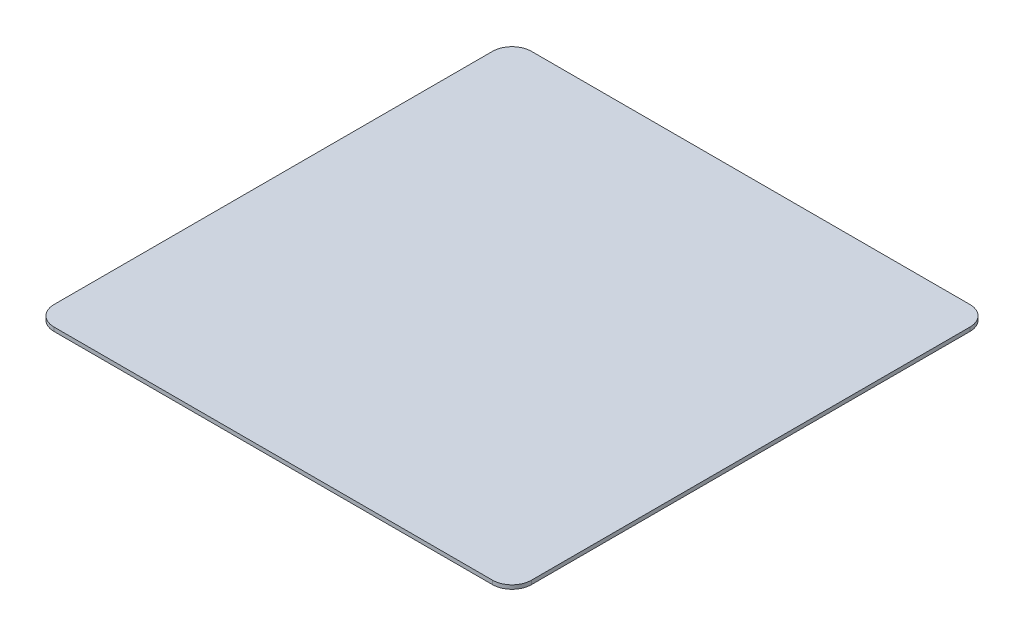
ISO-10303-21;
HEADER;
FILE_DESCRIPTION(('STEP AP214'),'2;1');
FILE_NAME('part.step','',(''),(''),'','','');
FILE_SCHEMA(('AUTOMOTIVE_DESIGN { 1 0 10303 214 1 1 1 1 }'));
ENDSEC;
DATA;
#1=APPLICATION_CONTEXT('core data for automotive mechanical design processes');
#2=APPLICATION_PROTOCOL_DEFINITION('international standard','automotive_design',2000,#1);
#3=PRODUCT_CONTEXT('',#1,'mechanical');
#4=PRODUCT('Part','Part','',(#3));
#5=PRODUCT_RELATED_PRODUCT_CATEGORY('part','',(#4));
#6=PRODUCT_DEFINITION_FORMATION('','',#4);
#7=PRODUCT_DEFINITION_CONTEXT('part definition',#1,'design');
#8=PRODUCT_DEFINITION('design','',#6,#7);
#9=PRODUCT_DEFINITION_SHAPE('','',#8);
#10=(LENGTH_UNIT() NAMED_UNIT(*) SI_UNIT(.MILLI.,.METRE.));
#11=(NAMED_UNIT(*) PLANE_ANGLE_UNIT() SI_UNIT($,.RADIAN.));
#12=(NAMED_UNIT(*) SI_UNIT($,.STERADIAN.) SOLID_ANGLE_UNIT());
#13=UNCERTAINTY_MEASURE_WITH_UNIT(LENGTH_MEASURE(1.E-05),#10,'distance_accuracy_value','');
#14=(GEOMETRIC_REPRESENTATION_CONTEXT(3) GLOBAL_UNCERTAINTY_ASSIGNED_CONTEXT((#13)) GLOBAL_UNIT_ASSIGNED_CONTEXT((#10,
#11,#12)) REPRESENTATION_CONTEXT('',''));
#15=CARTESIAN_POINT('',(0.,0.,0.));
#16=DIRECTION('',(0.,0.,1.));
#17=DIRECTION('',(1.,0.,0.));
#18=AXIS2_PLACEMENT_3D('',#15,#16,#17);
#19=CARTESIAN_POINT('',(122.5,2.,-122.5));
#20=DIRECTION('',(-1.,0.,0.));
#21=DIRECTION('',(0.,0.,1.));
#22=AXIS2_PLACEMENT_3D('',#19,#20,#21);
#23=PLANE('',#22);
#24=DIRECTION('',(0.,0.,-1.));
#25=VECTOR('',#24,1.);
#26=CARTESIAN_POINT('',(122.5,0.,-122.5));
#27=LINE('',#26,#25);
#28=CARTESIAN_POINT('',(122.5,0.,112.5));
#29=VERTEX_POINT('',#28);
#30=CARTESIAN_POINT('',(122.5,0.,-112.5));
#31=VERTEX_POINT('',#30);
#32=EDGE_CURVE('E135',#29,#31,#27,.T.);
#33=ORIENTED_EDGE('',*,*,#32,.T.);
#34=DIRECTION('',(0.,-1.,0.));
#35=VECTOR('',#34,1.);
#36=CARTESIAN_POINT('',(122.5,2.,-112.5));
#37=LINE('',#36,#35);
#38=CARTESIAN_POINT('',(122.5,2.,-112.5));
#39=VERTEX_POINT('',#38);
#40=EDGE_CURVE('E157',#31,#39,#37,.F.);
#41=ORIENTED_EDGE('',*,*,#40,.T.);
#42=DIRECTION('',(0.,0.,-1.));
#43=VECTOR('',#42,1.);
#44=CARTESIAN_POINT('',(122.5,2.,-122.5));
#45=LINE('',#44,#43);
#46=CARTESIAN_POINT('',(122.5,2.,112.5));
#47=VERTEX_POINT('',#46);
#48=EDGE_CURVE('E133',#47,#39,#45,.T.);
#49=ORIENTED_EDGE('',*,*,#48,.F.);
#50=DIRECTION('',(0.,-1.,0.));
#51=VECTOR('',#50,1.);
#52=CARTESIAN_POINT('',(122.5,2.,112.5));
#53=LINE('',#52,#51);
#54=EDGE_CURVE('E154',#47,#29,#53,.T.);
#55=ORIENTED_EDGE('',*,*,#54,.T.);
#56=EDGE_LOOP('',(#33,#41,#49,#55));
#57=FACE_BOUND('',#56,.T.);
#58=ADVANCED_FACE('F38',(#57),#23,.F.);
#59=CARTESIAN_POINT('',(-122.5,2.,-122.5));
#60=DIRECTION('',(0.,0.,1.));
#61=DIRECTION('',(1.,0.,0.));
#62=AXIS2_PLACEMENT_3D('',#59,#60,#61);
#63=PLANE('',#62);
#64=DIRECTION('',(-1.,0.,0.));
#65=VECTOR('',#64,1.);
#66=CARTESIAN_POINT('',(-122.5,0.,-122.5));
#67=LINE('',#66,#65);
#68=CARTESIAN_POINT('',(112.5,0.,-122.5));
#69=VERTEX_POINT('',#68);
#70=CARTESIAN_POINT('',(-112.5,0.,-122.5));
#71=VERTEX_POINT('',#70);
#72=EDGE_CURVE('E131',#69,#71,#67,.T.);
#73=ORIENTED_EDGE('',*,*,#72,.T.);
#74=DIRECTION('',(0.,-1.,0.));
#75=VECTOR('',#74,1.);
#76=CARTESIAN_POINT('',(-112.5,2.,-122.5));
#77=LINE('',#76,#75);
#78=CARTESIAN_POINT('',(-112.5,2.,-122.5));
#79=VERTEX_POINT('',#78);
#80=EDGE_CURVE('E109',#71,#79,#77,.F.);
#81=ORIENTED_EDGE('',*,*,#80,.T.);
#82=DIRECTION('',(-1.,0.,0.));
#83=VECTOR('',#82,1.);
#84=CARTESIAN_POINT('',(-122.5,2.,-122.5));
#85=LINE('',#84,#83);
#86=CARTESIAN_POINT('',(112.5,2.,-122.5));
#87=VERTEX_POINT('',#86);
#88=EDGE_CURVE('E171',#87,#79,#85,.T.);
#89=ORIENTED_EDGE('',*,*,#88,.F.);
#90=DIRECTION('',(0.,-1.,0.));
#91=VECTOR('',#90,1.);
#92=CARTESIAN_POINT('',(112.5,2.,-122.5));
#93=LINE('',#92,#91);
#94=EDGE_CURVE('E114',#87,#69,#93,.T.);
#95=ORIENTED_EDGE('',*,*,#94,.T.);
#96=EDGE_LOOP('',(#73,#81,#89,#95));
#97=FACE_BOUND('',#96,.T.);
#98=ADVANCED_FACE('F176',(#97),#63,.F.);
#99=CARTESIAN_POINT('',(-122.5,2.,-122.5));
#100=DIRECTION('',(1.,0.,0.));
#101=DIRECTION('',(0.,0.,-1.));
#102=AXIS2_PLACEMENT_3D('',#99,#100,#101);
#103=PLANE('',#102);
#104=DIRECTION('',(0.,0.,1.));
#105=VECTOR('',#104,1.);
#106=CARTESIAN_POINT('',(-122.5,2.,-122.5));
#107=LINE('',#106,#105);
#108=CARTESIAN_POINT('',(-122.5,2.,-112.5));
#109=VERTEX_POINT('',#108);
#110=CARTESIAN_POINT('',(-122.5,2.,112.5));
#111=VERTEX_POINT('',#110);
#112=EDGE_CURVE('E123',#109,#111,#107,.T.);
#113=ORIENTED_EDGE('',*,*,#112,.F.);
#114=DIRECTION('',(0.,-1.,0.));
#115=VECTOR('',#114,1.);
#116=CARTESIAN_POINT('',(-122.5,2.,-112.5));
#117=LINE('',#116,#115);
#118=CARTESIAN_POINT('',(-122.5,0.,-112.5));
#119=VERTEX_POINT('',#118);
#120=EDGE_CURVE('E108',#109,#119,#117,.T.);
#121=ORIENTED_EDGE('',*,*,#120,.T.);
#122=DIRECTION('',(0.,0.,1.));
#123=VECTOR('',#122,1.);
#124=CARTESIAN_POINT('',(-122.5,0.,-122.5));
#125=LINE('',#124,#123);
#126=CARTESIAN_POINT('',(-122.5,0.,112.5));
#127=VERTEX_POINT('',#126);
#128=EDGE_CURVE('E121',#119,#127,#125,.T.);
#129=ORIENTED_EDGE('',*,*,#128,.T.);
#130=DIRECTION('',(0.,-1.,0.));
#131=VECTOR('',#130,1.);
#132=CARTESIAN_POINT('',(-122.5,2.,112.5));
#133=LINE('',#132,#131);
#134=EDGE_CURVE('E125',#127,#111,#133,.F.);
#135=ORIENTED_EDGE('',*,*,#134,.T.);
#136=EDGE_LOOP('',(#113,#121,#129,#135));
#137=FACE_BOUND('',#136,.T.);
#138=ADVANCED_FACE('F120',(#137),#103,.F.);
#139=CARTESIAN_POINT('',(-122.5,2.,122.5));
#140=DIRECTION('',(0.,0.,-1.));
#141=DIRECTION('',(-1.,0.,0.));
#142=AXIS2_PLACEMENT_3D('',#139,#140,#141);
#143=PLANE('',#142);
#144=DIRECTION('',(1.,0.,0.));
#145=VECTOR('',#144,1.);
#146=CARTESIAN_POINT('',(-122.5,2.,122.5));
#147=LINE('',#146,#145);
#148=CARTESIAN_POINT('',(-112.5,2.,122.5));
#149=VERTEX_POINT('',#148);
#150=CARTESIAN_POINT('',(112.5,2.,122.5));
#151=VERTEX_POINT('',#150);
#152=EDGE_CURVE('E139',#149,#151,#147,.T.);
#153=ORIENTED_EDGE('',*,*,#152,.F.);
#154=DIRECTION('',(0.,-1.,0.));
#155=VECTOR('',#154,1.);
#156=CARTESIAN_POINT('',(-112.5,2.,122.5));
#157=LINE('',#156,#155);
#158=CARTESIAN_POINT('',(-112.5,0.,122.5));
#159=VERTEX_POINT('',#158);
#160=EDGE_CURVE('E11',#149,#159,#157,.T.);
#161=ORIENTED_EDGE('',*,*,#160,.T.);
#162=DIRECTION('',(1.,0.,0.));
#163=VECTOR('',#162,1.);
#164=CARTESIAN_POINT('',(-122.5,0.,122.5));
#165=LINE('',#164,#163);
#166=CARTESIAN_POINT('',(112.5,0.,122.5));
#167=VERTEX_POINT('',#166);
#168=EDGE_CURVE('E130',#159,#167,#165,.T.);
#169=ORIENTED_EDGE('',*,*,#168,.T.);
#170=DIRECTION('',(0.,-1.,0.));
#171=VECTOR('',#170,1.);
#172=CARTESIAN_POINT('',(112.5,2.,122.5));
#173=LINE('',#172,#171);
#174=EDGE_CURVE('E46',#167,#151,#173,.F.);
#175=ORIENTED_EDGE('',*,*,#174,.T.);
#176=EDGE_LOOP('',(#153,#161,#169,#175));
#177=FACE_BOUND('',#176,.T.);
#178=ADVANCED_FACE('F183',(#177),#143,.F.);
#179=CARTESIAN_POINT('',(0.,2.,0.));
#180=DIRECTION('',(0.,1.,0.));
#181=DIRECTION('',(0.,0.,1.));
#182=AXIS2_PLACEMENT_3D('',#179,#180,#181);
#183=PLANE('',#182);
#184=ORIENTED_EDGE('',*,*,#88,.T.);
#185=CARTESIAN_POINT('',(-112.5,2.,-112.5));
#186=DIRECTION('',(0.,1.,0.));
#187=DIRECTION('',(0.,0.,1.));
#188=AXIS2_PLACEMENT_3D('',#185,#186,#187);
#189=CIRCLE('',#188,10.);
#190=EDGE_CURVE('E152',#79,#109,#189,.T.);
#191=ORIENTED_EDGE('',*,*,#190,.T.);
#192=ORIENTED_EDGE('',*,*,#112,.T.);
#193=CARTESIAN_POINT('',(-112.5,2.,112.5));
#194=DIRECTION('',(0.,1.,0.));
#195=DIRECTION('',(0.,0.,1.));
#196=AXIS2_PLACEMENT_3D('',#193,#194,#195);
#197=CIRCLE('',#196,10.);
#198=EDGE_CURVE('E59',#111,#149,#197,.T.);
#199=ORIENTED_EDGE('',*,*,#198,.T.);
#200=ORIENTED_EDGE('',*,*,#152,.T.);
#201=CARTESIAN_POINT('',(112.5,2.,112.5));
#202=DIRECTION('',(0.,1.,0.));
#203=DIRECTION('',(0.,0.,1.));
#204=AXIS2_PLACEMENT_3D('',#201,#202,#203);
#205=CIRCLE('',#204,10.);
#206=EDGE_CURVE('E147',#151,#47,#205,.T.);
#207=ORIENTED_EDGE('',*,*,#206,.T.);
#208=ORIENTED_EDGE('',*,*,#48,.T.);
#209=CARTESIAN_POINT('',(112.5,2.,-112.5));
#210=DIRECTION('',(0.,1.,0.));
#211=DIRECTION('',(0.,0.,1.));
#212=AXIS2_PLACEMENT_3D('',#209,#210,#211);
#213=CIRCLE('',#212,10.);
#214=EDGE_CURVE('E150',#39,#87,#213,.T.);
#215=ORIENTED_EDGE('',*,*,#214,.T.);
#216=EDGE_LOOP('',(#184,#191,#192,#199,#200,#207,#208,#215));
#217=FACE_BOUND('',#216,.T.);
#218=ADVANCED_FACE('F168',(#217),#183,.T.);
#219=CARTESIAN_POINT('',(0.,0.,0.));
#220=DIRECTION('',(0.,1.,0.));
#221=DIRECTION('',(0.,0.,1.));
#222=AXIS2_PLACEMENT_3D('',#219,#220,#221);
#223=PLANE('',#222);
#224=ORIENTED_EDGE('',*,*,#128,.F.);
#225=CARTESIAN_POINT('',(-112.5,0.,-112.5));
#226=DIRECTION('',(0.,1.,0.));
#227=DIRECTION('',(0.,0.,1.));
#228=AXIS2_PLACEMENT_3D('',#225,#226,#227);
#229=CIRCLE('',#228,10.);
#230=EDGE_CURVE('E104',#119,#71,#229,.F.);
#231=ORIENTED_EDGE('',*,*,#230,.T.);
#232=ORIENTED_EDGE('',*,*,#72,.F.);
#233=CARTESIAN_POINT('',(112.5,0.,-112.5));
#234=DIRECTION('',(0.,1.,0.));
#235=DIRECTION('',(0.,0.,1.));
#236=AXIS2_PLACEMENT_3D('',#233,#234,#235);
#237=CIRCLE('',#236,10.);
#238=EDGE_CURVE('E115',#69,#31,#237,.F.);
#239=ORIENTED_EDGE('',*,*,#238,.T.);
#240=ORIENTED_EDGE('',*,*,#32,.F.);
#241=CARTESIAN_POINT('',(112.5,0.,112.5));
#242=DIRECTION('',(0.,1.,0.));
#243=DIRECTION('',(0.,0.,1.));
#244=AXIS2_PLACEMENT_3D('',#241,#242,#243);
#245=CIRCLE('',#244,10.);
#246=EDGE_CURVE('E124',#29,#167,#245,.F.);
#247=ORIENTED_EDGE('',*,*,#246,.T.);
#248=ORIENTED_EDGE('',*,*,#168,.F.);
#249=CARTESIAN_POINT('',(-112.5,0.,112.5));
#250=DIRECTION('',(0.,1.,0.));
#251=DIRECTION('',(0.,0.,1.));
#252=AXIS2_PLACEMENT_3D('',#249,#250,#251);
#253=CIRCLE('',#252,10.);
#254=EDGE_CURVE('E129',#159,#127,#253,.F.);
#255=ORIENTED_EDGE('',*,*,#254,.T.);
#256=EDGE_LOOP('',(#224,#231,#232,#239,#240,#247,#248,#255));
#257=FACE_BOUND('',#256,.T.);
#258=ADVANCED_FACE('F127',(#257),#223,.F.);
#259=CARTESIAN_POINT('',(-112.5,2.,-112.5));
#260=DIRECTION('',(0.,-1.,0.));
#261=DIRECTION('',(0.,0.,-1.));
#262=AXIS2_PLACEMENT_3D('',#259,#260,#261);
#263=CYLINDRICAL_SURFACE('',#262,10.);
#264=ORIENTED_EDGE('',*,*,#190,.F.);
#265=ORIENTED_EDGE('',*,*,#80,.F.);
#266=ORIENTED_EDGE('',*,*,#230,.F.);
#267=ORIENTED_EDGE('',*,*,#120,.F.);
#268=EDGE_LOOP('',(#264,#265,#266,#267));
#269=FACE_BOUND('',#268,.T.);
#270=ADVANCED_FACE('F107',(#269),#263,.T.);
#271=CARTESIAN_POINT('',(112.5,2.,-112.5));
#272=DIRECTION('',(0.,-1.,0.));
#273=DIRECTION('',(0.,0.,-1.));
#274=AXIS2_PLACEMENT_3D('',#271,#272,#273);
#275=CYLINDRICAL_SURFACE('',#274,10.);
#276=ORIENTED_EDGE('',*,*,#214,.F.);
#277=ORIENTED_EDGE('',*,*,#40,.F.);
#278=ORIENTED_EDGE('',*,*,#238,.F.);
#279=ORIENTED_EDGE('',*,*,#94,.F.);
#280=EDGE_LOOP('',(#276,#277,#278,#279));
#281=FACE_BOUND('',#280,.T.);
#282=ADVANCED_FACE('F174',(#281),#275,.T.);
#283=CARTESIAN_POINT('',(-112.5,2.,112.5));
#284=DIRECTION('',(0.,-1.,0.));
#285=DIRECTION('',(0.,0.,-1.));
#286=AXIS2_PLACEMENT_3D('',#283,#284,#285);
#287=CYLINDRICAL_SURFACE('',#286,10.);
#288=ORIENTED_EDGE('',*,*,#198,.F.);
#289=ORIENTED_EDGE('',*,*,#134,.F.);
#290=ORIENTED_EDGE('',*,*,#254,.F.);
#291=ORIENTED_EDGE('',*,*,#160,.F.);
#292=EDGE_LOOP('',(#288,#289,#290,#291));
#293=FACE_BOUND('',#292,.T.);
#294=ADVANCED_FACE('F182',(#293),#287,.T.);
#295=CARTESIAN_POINT('',(112.5,2.,112.5));
#296=DIRECTION('',(0.,-1.,0.));
#297=DIRECTION('',(0.,0.,-1.));
#298=AXIS2_PLACEMENT_3D('',#295,#296,#297);
#299=CYLINDRICAL_SURFACE('',#298,10.);
#300=ORIENTED_EDGE('',*,*,#206,.F.);
#301=ORIENTED_EDGE('',*,*,#174,.F.);
#302=ORIENTED_EDGE('',*,*,#246,.F.);
#303=ORIENTED_EDGE('',*,*,#54,.F.);
#304=EDGE_LOOP('',(#300,#301,#302,#303));
#305=FACE_BOUND('',#304,.T.);
#306=ADVANCED_FACE('F40',(#305),#299,.T.);
#307=CLOSED_SHELL('',(#58,#98,#138,#178,#218,#258,#270,#282,#294,#306));
#308=MANIFOLD_SOLID_BREP('B2',#307);
#309=ADVANCED_BREP_SHAPE_REPRESENTATION('',(#18,#308),#14);
#310=SHAPE_DEFINITION_REPRESENTATION(#9,#309);
ENDSEC;
END-ISO-10303-21;
